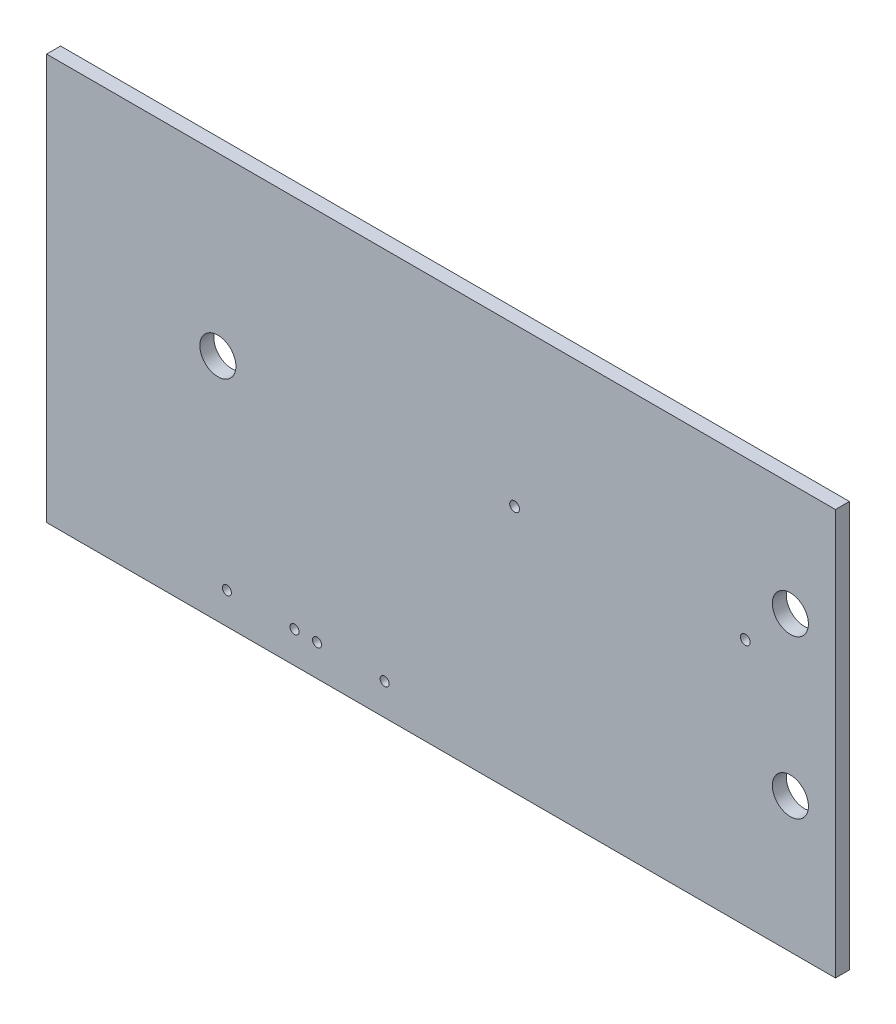
ISO-10303-21;
HEADER;
FILE_DESCRIPTION(('STEP AP214'),'2;1');
FILE_NAME('part.step','',(''),(''),'','','');
FILE_SCHEMA(('AUTOMOTIVE_DESIGN { 1 0 10303 214 1 1 1 1 }'));
ENDSEC;
DATA;
#1=APPLICATION_CONTEXT('core data for automotive mechanical design processes');
#2=APPLICATION_PROTOCOL_DEFINITION('international standard','automotive_design',2000,#1);
#3=PRODUCT_CONTEXT('',#1,'mechanical');
#4=PRODUCT('Part','Part','',(#3));
#5=PRODUCT_RELATED_PRODUCT_CATEGORY('part','',(#4));
#6=PRODUCT_DEFINITION_FORMATION('','',#4);
#7=PRODUCT_DEFINITION_CONTEXT('part definition',#1,'design');
#8=PRODUCT_DEFINITION('design','',#6,#7);
#9=PRODUCT_DEFINITION_SHAPE('','',#8);
#10=(LENGTH_UNIT() NAMED_UNIT(*) SI_UNIT(.MILLI.,.METRE.));
#11=(NAMED_UNIT(*) PLANE_ANGLE_UNIT() SI_UNIT($,.RADIAN.));
#12=(NAMED_UNIT(*) SI_UNIT($,.STERADIAN.) SOLID_ANGLE_UNIT());
#13=UNCERTAINTY_MEASURE_WITH_UNIT(LENGTH_MEASURE(1.E-05),#10,'distance_accuracy_value','');
#14=(GEOMETRIC_REPRESENTATION_CONTEXT(3) GLOBAL_UNCERTAINTY_ASSIGNED_CONTEXT((#13)) GLOBAL_UNIT_ASSIGNED_CONTEXT((#10,
#11,#12)) REPRESENTATION_CONTEXT('',''));
#15=CARTESIAN_POINT('',(0.,0.,0.));
#16=DIRECTION('',(0.,0.,1.));
#17=DIRECTION('',(1.,0.,0.));
#18=AXIS2_PLACEMENT_3D('',#15,#16,#17);
#19=CARTESIAN_POINT('',(0.,0.,1.5748));
#20=DIRECTION('',(1.,0.,0.));
#21=DIRECTION('',(0.,1.,0.));
#22=AXIS2_PLACEMENT_3D('',#19,#20,#21);
#23=PLANE('',#22);
#24=DIRECTION('',(0.,-1.,0.));
#25=VECTOR('',#24,1.);
#26=CARTESIAN_POINT('',(0.,0.,0.));
#27=LINE('',#26,#25);
#28=CARTESIAN_POINT('',(0.,0.,0.));
#29=VERTEX_POINT('',#28);
#30=CARTESIAN_POINT('',(0.,-45.72,0.));
#31=VERTEX_POINT('',#30);
#32=EDGE_CURVE('E75',#29,#31,#27,.T.);
#33=ORIENTED_EDGE('',*,*,#32,.T.);
#34=DIRECTION('',(0.,0.,-1.));
#35=VECTOR('',#34,1.);
#36=CARTESIAN_POINT('',(0.,-45.72,1.5748));
#37=LINE('',#36,#35);
#38=CARTESIAN_POINT('',(0.,-45.72,1.5748));
#39=VERTEX_POINT('',#38);
#40=EDGE_CURVE('E11',#39,#31,#37,.T.);
#41=ORIENTED_EDGE('',*,*,#40,.F.);
#42=DIRECTION('',(0.,-1.,0.));
#43=VECTOR('',#42,1.);
#44=CARTESIAN_POINT('',(0.,0.,1.5748));
#45=LINE('',#44,#43);
#46=CARTESIAN_POINT('',(0.,0.,1.5748));
#47=VERTEX_POINT('',#46);
#48=EDGE_CURVE('E98',#47,#39,#45,.T.);
#49=ORIENTED_EDGE('',*,*,#48,.F.);
#50=DIRECTION('',(0.,0.,-1.));
#51=VECTOR('',#50,1.);
#52=CARTESIAN_POINT('',(0.,0.,1.5748));
#53=LINE('',#52,#51);
#54=EDGE_CURVE('E87',#47,#29,#53,.T.);
#55=ORIENTED_EDGE('',*,*,#54,.T.);
#56=EDGE_LOOP('',(#33,#41,#49,#55));
#57=FACE_BOUND('',#56,.T.);
#58=ADVANCED_FACE('F31',(#57),#23,.F.);
#59=CARTESIAN_POINT('',(0.,-45.72,1.5748));
#60=DIRECTION('',(0.,1.,0.));
#61=DIRECTION('',(0.,0.,1.));
#62=AXIS2_PLACEMENT_3D('',#59,#60,#61);
#63=PLANE('',#62);
#64=DIRECTION('',(1.,0.,0.));
#65=VECTOR('',#64,1.);
#66=CARTESIAN_POINT('',(0.,-45.72,0.));
#67=LINE('',#66,#65);
#68=CARTESIAN_POINT('',(88.9,-45.72,0.));
#69=VERTEX_POINT('',#68);
#70=EDGE_CURVE('E71',#31,#69,#67,.T.);
#71=ORIENTED_EDGE('',*,*,#70,.T.);
#72=DIRECTION('',(0.,0.,-1.));
#73=VECTOR('',#72,1.);
#74=CARTESIAN_POINT('',(88.9,-45.72,1.5748));
#75=LINE('',#74,#73);
#76=CARTESIAN_POINT('',(88.9,-45.72,1.5748));
#77=VERTEX_POINT('',#76);
#78=EDGE_CURVE('E38',#77,#69,#75,.T.);
#79=ORIENTED_EDGE('',*,*,#78,.F.);
#80=DIRECTION('',(1.,0.,0.));
#81=VECTOR('',#80,1.);
#82=CARTESIAN_POINT('',(0.,-45.72,1.5748));
#83=LINE('',#82,#81);
#84=EDGE_CURVE('E83',#39,#77,#83,.T.);
#85=ORIENTED_EDGE('',*,*,#84,.F.);
#86=ORIENTED_EDGE('',*,*,#40,.T.);
#87=EDGE_LOOP('',(#71,#79,#85,#86));
#88=FACE_BOUND('',#87,.T.);
#89=ADVANCED_FACE('F82',(#88),#63,.F.);
#90=CARTESIAN_POINT('',(88.9,0.,1.5748));
#91=DIRECTION('',(-1.,0.,0.));
#92=DIRECTION('',(0.,0.,1.));
#93=AXIS2_PLACEMENT_3D('',#90,#91,#92);
#94=PLANE('',#93);
#95=DIRECTION('',(0.,1.,0.));
#96=VECTOR('',#95,1.);
#97=CARTESIAN_POINT('',(88.9,0.,0.));
#98=LINE('',#97,#96);
#99=CARTESIAN_POINT('',(88.9,0.,0.));
#100=VERTEX_POINT('',#99);
#101=EDGE_CURVE('E76',#69,#100,#98,.T.);
#102=ORIENTED_EDGE('',*,*,#101,.T.);
#103=DIRECTION('',(0.,0.,-1.));
#104=VECTOR('',#103,1.);
#105=CARTESIAN_POINT('',(88.9,0.,1.5748));
#106=LINE('',#105,#104);
#107=CARTESIAN_POINT('',(88.9,0.,1.5748));
#108=VERTEX_POINT('',#107);
#109=EDGE_CURVE('E104',#108,#100,#106,.T.);
#110=ORIENTED_EDGE('',*,*,#109,.F.);
#111=DIRECTION('',(0.,1.,0.));
#112=VECTOR('',#111,1.);
#113=CARTESIAN_POINT('',(88.9,0.,1.5748));
#114=LINE('',#113,#112);
#115=EDGE_CURVE('E50',#77,#108,#114,.T.);
#116=ORIENTED_EDGE('',*,*,#115,.F.);
#117=ORIENTED_EDGE('',*,*,#78,.T.);
#118=EDGE_LOOP('',(#102,#110,#116,#117));
#119=FACE_BOUND('',#118,.T.);
#120=ADVANCED_FACE('F107',(#119),#94,.F.);
#121=CARTESIAN_POINT('',(0.,0.,1.5748));
#122=DIRECTION('',(0.,-1.,0.));
#123=DIRECTION('',(0.,0.,-1.));
#124=AXIS2_PLACEMENT_3D('',#121,#122,#123);
#125=PLANE('',#124);
#126=DIRECTION('',(-1.,0.,0.));
#127=VECTOR('',#126,1.);
#128=CARTESIAN_POINT('',(0.,0.,0.));
#129=LINE('',#128,#127);
#130=EDGE_CURVE('E96',#100,#29,#129,.T.);
#131=ORIENTED_EDGE('',*,*,#130,.T.);
#132=ORIENTED_EDGE('',*,*,#54,.F.);
#133=DIRECTION('',(-1.,0.,0.));
#134=VECTOR('',#133,1.);
#135=CARTESIAN_POINT('',(0.,0.,1.5748));
#136=LINE('',#135,#134);
#137=EDGE_CURVE('E45',#108,#47,#136,.T.);
#138=ORIENTED_EDGE('',*,*,#137,.F.);
#139=ORIENTED_EDGE('',*,*,#109,.T.);
#140=EDGE_LOOP('',(#131,#132,#138,#139));
#141=FACE_BOUND('',#140,.T.);
#142=ADVANCED_FACE('F109',(#141),#125,.F.);
#143=CARTESIAN_POINT('',(0.,-45.72,1.5748));
#144=DIRECTION('',(0.,0.,1.));
#145=DIRECTION('',(1.,0.,0.));
#146=AXIS2_PLACEMENT_3D('',#143,#144,#145);
#147=PLANE('',#146);
#148=CARTESIAN_POINT('',(19.304,-19.812,1.5748));
#149=DIRECTION('',(0.,0.,1.));
#150=DIRECTION('',(1.,0.,0.));
#151=AXIS2_PLACEMENT_3D('',#148,#149,#150);
#152=CIRCLE('',#151,2.032);
#153=CARTESIAN_POINT('',(21.336,-19.812,1.5748));
#154=VERTEX_POINT('',#153);
#155=EDGE_CURVE('E246',#154,#154,#152,.T.);
#156=ORIENTED_EDGE('',*,*,#155,.F.);
#157=EDGE_LOOP('',(#156));
#158=FACE_BOUND('',#157,.T.);
#159=CARTESIAN_POINT('',(83.82,-12.7,1.5748));
#160=DIRECTION('',(0.,0.,1.));
#161=DIRECTION('',(1.,0.,0.));
#162=AXIS2_PLACEMENT_3D('',#159,#160,#161);
#163=CIRCLE('',#162,2.03200000000001);
#164=CARTESIAN_POINT('',(85.852,-12.7,1.5748));
#165=VERTEX_POINT('',#164);
#166=EDGE_CURVE('E248',#165,#165,#163,.T.);
#167=ORIENTED_EDGE('',*,*,#166,.F.);
#168=EDGE_LOOP('',(#167));
#169=FACE_BOUND('',#168,.T.);
#170=CARTESIAN_POINT('',(83.82,-30.48,1.5748));
#171=DIRECTION('',(0.,0.,1.));
#172=DIRECTION('',(1.,0.,0.));
#173=AXIS2_PLACEMENT_3D('',#170,#171,#172);
#174=CIRCLE('',#173,2.03200000000001);
#175=CARTESIAN_POINT('',(85.852,-30.48,1.5748));
#176=VERTEX_POINT('',#175);
#177=EDGE_CURVE('E256',#176,#176,#174,.T.);
#178=ORIENTED_EDGE('',*,*,#177,.F.);
#179=EDGE_LOOP('',(#178));
#180=FACE_BOUND('',#179,.T.);
#181=CARTESIAN_POINT('',(38.1,-42.164,1.5748));
#182=DIRECTION('',(0.,0.,1.));
#183=DIRECTION('',(1.,0.,0.));
#184=AXIS2_PLACEMENT_3D('',#181,#182,#183);
#185=CIRCLE('',#184,0.508000000000001);
#186=CARTESIAN_POINT('',(38.608,-42.164,1.5748));
#187=VERTEX_POINT('',#186);
#188=EDGE_CURVE('E262',#187,#187,#185,.T.);
#189=ORIENTED_EDGE('',*,*,#188,.F.);
#190=EDGE_LOOP('',(#189));
#191=FACE_BOUND('',#190,.T.);
#192=CARTESIAN_POINT('',(30.48,-42.164,1.5748));
#193=DIRECTION('',(0.,0.,1.));
#194=DIRECTION('',(1.,0.,0.));
#195=AXIS2_PLACEMENT_3D('',#192,#193,#194);
#196=CIRCLE('',#195,0.508000000000001);
#197=CARTESIAN_POINT('',(30.988,-42.164,1.5748));
#198=VERTEX_POINT('',#197);
#199=EDGE_CURVE('E268',#198,#198,#196,.T.);
#200=ORIENTED_EDGE('',*,*,#199,.F.);
#201=EDGE_LOOP('',(#200));
#202=FACE_BOUND('',#201,.T.);
#203=CARTESIAN_POINT('',(27.94,-42.164,1.5748));
#204=DIRECTION('',(0.,0.,1.));
#205=DIRECTION('',(1.,0.,0.));
#206=AXIS2_PLACEMENT_3D('',#203,#204,#205);
#207=CIRCLE('',#206,0.508000000000001);
#208=CARTESIAN_POINT('',(28.448,-42.164,1.5748));
#209=VERTEX_POINT('',#208);
#210=EDGE_CURVE('E274',#209,#209,#207,.T.);
#211=ORIENTED_EDGE('',*,*,#210,.F.);
#212=EDGE_LOOP('',(#211));
#213=FACE_BOUND('',#212,.T.);
#214=CARTESIAN_POINT('',(20.32,-42.164,1.5748));
#215=DIRECTION('',(0.,0.,1.));
#216=DIRECTION('',(1.,0.,0.));
#217=AXIS2_PLACEMENT_3D('',#214,#215,#216);
#218=CIRCLE('',#217,0.507999999999994);
#219=CARTESIAN_POINT('',(20.828,-42.164,1.5748));
#220=VERTEX_POINT('',#219);
#221=EDGE_CURVE('E280',#220,#220,#218,.T.);
#222=ORIENTED_EDGE('',*,*,#221,.F.);
#223=EDGE_LOOP('',(#222));
#224=FACE_BOUND('',#223,.T.);
#225=CARTESIAN_POINT('',(78.74,-17.78,1.5748));
#226=DIRECTION('',(0.,0.,1.));
#227=DIRECTION('',(1.,0.,0.));
#228=AXIS2_PLACEMENT_3D('',#225,#226,#227);
#229=CIRCLE('',#228,0.549999999999996);
#230=CARTESIAN_POINT('',(79.29,-17.78,1.5748));
#231=VERTEX_POINT('',#230);
#232=EDGE_CURVE('E286',#231,#231,#229,.T.);
#233=ORIENTED_EDGE('',*,*,#232,.F.);
#234=EDGE_LOOP('',(#233));
#235=FACE_BOUND('',#234,.T.);
#236=CARTESIAN_POINT('',(52.74,-17.78,1.5748));
#237=DIRECTION('',(0.,0.,1.));
#238=DIRECTION('',(1.,0.,0.));
#239=AXIS2_PLACEMENT_3D('',#236,#237,#238);
#240=CIRCLE('',#239,0.550000000000003);
#241=CARTESIAN_POINT('',(53.29,-17.78,1.5748));
#242=VERTEX_POINT('',#241);
#243=EDGE_CURVE('E91',#242,#242,#240,.T.);
#244=ORIENTED_EDGE('',*,*,#243,.F.);
#245=EDGE_LOOP('',(#244));
#246=FACE_BOUND('',#245,.T.);
#247=ORIENTED_EDGE('',*,*,#48,.T.);
#248=ORIENTED_EDGE('',*,*,#84,.T.);
#249=ORIENTED_EDGE('',*,*,#115,.T.);
#250=ORIENTED_EDGE('',*,*,#137,.T.);
#251=EDGE_LOOP('',(#247,#248,#249,#250));
#252=FACE_BOUND('',#251,.T.);
#253=ADVANCED_FACE('F110',(#158,#169,#180,#191,#202,#213,#224,#235,#246,#252),#147,.T.);
#254=CARTESIAN_POINT('',(0.,-45.72,0.));
#255=DIRECTION('',(0.,0.,1.));
#256=DIRECTION('',(1.,0.,0.));
#257=AXIS2_PLACEMENT_3D('',#254,#255,#256);
#258=PLANE('',#257);
#259=CARTESIAN_POINT('',(19.304,-19.812,0.));
#260=DIRECTION('',(0.,0.,1.));
#261=DIRECTION('',(1.,0.,0.));
#262=AXIS2_PLACEMENT_3D('',#259,#260,#261);
#263=CIRCLE('',#262,2.032);
#264=CARTESIAN_POINT('',(21.336,-19.812,0.));
#265=VERTEX_POINT('',#264);
#266=EDGE_CURVE('E244',#265,#265,#263,.T.);
#267=ORIENTED_EDGE('',*,*,#266,.T.);
#268=EDGE_LOOP('',(#267));
#269=FACE_BOUND('',#268,.T.);
#270=CARTESIAN_POINT('',(83.82,-12.7,0.));
#271=DIRECTION('',(0.,0.,1.));
#272=DIRECTION('',(1.,0.,0.));
#273=AXIS2_PLACEMENT_3D('',#270,#271,#272);
#274=CIRCLE('',#273,2.03200000000001);
#275=CARTESIAN_POINT('',(85.852,-12.7,0.));
#276=VERTEX_POINT('',#275);
#277=EDGE_CURVE('E253',#276,#276,#274,.T.);
#278=ORIENTED_EDGE('',*,*,#277,.T.);
#279=EDGE_LOOP('',(#278));
#280=FACE_BOUND('',#279,.T.);
#281=CARTESIAN_POINT('',(83.82,-30.48,0.));
#282=DIRECTION('',(0.,0.,1.));
#283=DIRECTION('',(1.,0.,0.));
#284=AXIS2_PLACEMENT_3D('',#281,#282,#283);
#285=CIRCLE('',#284,2.03200000000001);
#286=CARTESIAN_POINT('',(85.852,-30.48,0.));
#287=VERTEX_POINT('',#286);
#288=EDGE_CURVE('E259',#287,#287,#285,.T.);
#289=ORIENTED_EDGE('',*,*,#288,.T.);
#290=EDGE_LOOP('',(#289));
#291=FACE_BOUND('',#290,.T.);
#292=CARTESIAN_POINT('',(38.1,-42.164,0.));
#293=DIRECTION('',(0.,0.,1.));
#294=DIRECTION('',(1.,0.,0.));
#295=AXIS2_PLACEMENT_3D('',#292,#293,#294);
#296=CIRCLE('',#295,0.508000000000001);
#297=CARTESIAN_POINT('',(38.608,-42.164,0.));
#298=VERTEX_POINT('',#297);
#299=EDGE_CURVE('E265',#298,#298,#296,.T.);
#300=ORIENTED_EDGE('',*,*,#299,.T.);
#301=EDGE_LOOP('',(#300));
#302=FACE_BOUND('',#301,.T.);
#303=CARTESIAN_POINT('',(30.48,-42.164,0.));
#304=DIRECTION('',(0.,0.,1.));
#305=DIRECTION('',(1.,0.,0.));
#306=AXIS2_PLACEMENT_3D('',#303,#304,#305);
#307=CIRCLE('',#306,0.508000000000001);
#308=CARTESIAN_POINT('',(30.988,-42.164,0.));
#309=VERTEX_POINT('',#308);
#310=EDGE_CURVE('E271',#309,#309,#307,.T.);
#311=ORIENTED_EDGE('',*,*,#310,.T.);
#312=EDGE_LOOP('',(#311));
#313=FACE_BOUND('',#312,.T.);
#314=CARTESIAN_POINT('',(27.94,-42.164,0.));
#315=DIRECTION('',(0.,0.,1.));
#316=DIRECTION('',(1.,0.,0.));
#317=AXIS2_PLACEMENT_3D('',#314,#315,#316);
#318=CIRCLE('',#317,0.508000000000001);
#319=CARTESIAN_POINT('',(28.448,-42.164,0.));
#320=VERTEX_POINT('',#319);
#321=EDGE_CURVE('E277',#320,#320,#318,.T.);
#322=ORIENTED_EDGE('',*,*,#321,.T.);
#323=EDGE_LOOP('',(#322));
#324=FACE_BOUND('',#323,.T.);
#325=CARTESIAN_POINT('',(20.32,-42.164,0.));
#326=DIRECTION('',(0.,0.,1.));
#327=DIRECTION('',(1.,0.,0.));
#328=AXIS2_PLACEMENT_3D('',#325,#326,#327);
#329=CIRCLE('',#328,0.507999999999994);
#330=CARTESIAN_POINT('',(20.828,-42.164,0.));
#331=VERTEX_POINT('',#330);
#332=EDGE_CURVE('E283',#331,#331,#329,.T.);
#333=ORIENTED_EDGE('',*,*,#332,.T.);
#334=EDGE_LOOP('',(#333));
#335=FACE_BOUND('',#334,.T.);
#336=CARTESIAN_POINT('',(78.74,-17.78,0.));
#337=DIRECTION('',(0.,0.,1.));
#338=DIRECTION('',(1.,0.,0.));
#339=AXIS2_PLACEMENT_3D('',#336,#337,#338);
#340=CIRCLE('',#339,0.549999999999996);
#341=CARTESIAN_POINT('',(79.29,-17.78,0.));
#342=VERTEX_POINT('',#341);
#343=EDGE_CURVE('E289',#342,#342,#340,.T.);
#344=ORIENTED_EDGE('',*,*,#343,.T.);
#345=EDGE_LOOP('',(#344));
#346=FACE_BOUND('',#345,.T.);
#347=CARTESIAN_POINT('',(52.74,-17.78,0.));
#348=DIRECTION('',(0.,0.,1.));
#349=DIRECTION('',(1.,0.,0.));
#350=AXIS2_PLACEMENT_3D('',#347,#348,#349);
#351=CIRCLE('',#350,0.550000000000003);
#352=CARTESIAN_POINT('',(53.29,-17.78,0.));
#353=VERTEX_POINT('',#352);
#354=EDGE_CURVE('E88',#353,#353,#351,.T.);
#355=ORIENTED_EDGE('',*,*,#354,.T.);
#356=EDGE_LOOP('',(#355));
#357=FACE_BOUND('',#356,.T.);
#358=ORIENTED_EDGE('',*,*,#32,.F.);
#359=ORIENTED_EDGE('',*,*,#130,.F.);
#360=ORIENTED_EDGE('',*,*,#101,.F.);
#361=ORIENTED_EDGE('',*,*,#70,.F.);
#362=EDGE_LOOP('',(#358,#359,#360,#361));
#363=FACE_BOUND('',#362,.T.);
#364=ADVANCED_FACE('F72',(#269,#280,#291,#302,#313,#324,#335,#346,#357,#363),#258,.F.);
#365=CARTESIAN_POINT('',(52.74,-17.78,0.));
#366=DIRECTION('',(0.,0.,1.));
#367=DIRECTION('',(1.,0.,0.));
#368=AXIS2_PLACEMENT_3D('',#365,#366,#367);
#369=CYLINDRICAL_SURFACE('',#368,0.550000000000003);
#370=ORIENTED_EDGE('',*,*,#354,.F.);
#371=EDGE_LOOP('',(#370));
#372=FACE_BOUND('',#371,.T.);
#373=ORIENTED_EDGE('',*,*,#243,.T.);
#374=EDGE_LOOP('',(#373));
#375=FACE_BOUND('',#374,.T.);
#376=ADVANCED_FACE('F118',(#372,#375),#369,.F.);
#377=CARTESIAN_POINT('',(78.74,-17.78,0.));
#378=DIRECTION('',(0.,0.,1.));
#379=DIRECTION('',(1.,0.,0.));
#380=AXIS2_PLACEMENT_3D('',#377,#378,#379);
#381=CYLINDRICAL_SURFACE('',#380,0.549999999999996);
#382=ORIENTED_EDGE('',*,*,#343,.F.);
#383=EDGE_LOOP('',(#382));
#384=FACE_BOUND('',#383,.T.);
#385=ORIENTED_EDGE('',*,*,#232,.T.);
#386=EDGE_LOOP('',(#385));
#387=FACE_BOUND('',#386,.T.);
#388=ADVANCED_FACE('F148',(#384,#387),#381,.F.);
#389=CARTESIAN_POINT('',(20.32,-42.164,0.));
#390=DIRECTION('',(0.,0.,1.));
#391=DIRECTION('',(1.,0.,0.));
#392=AXIS2_PLACEMENT_3D('',#389,#390,#391);
#393=CYLINDRICAL_SURFACE('',#392,0.507999999999994);
#394=ORIENTED_EDGE('',*,*,#332,.F.);
#395=EDGE_LOOP('',(#394));
#396=FACE_BOUND('',#395,.T.);
#397=ORIENTED_EDGE('',*,*,#221,.T.);
#398=EDGE_LOOP('',(#397));
#399=FACE_BOUND('',#398,.T.);
#400=ADVANCED_FACE('F159',(#396,#399),#393,.F.);
#401=CARTESIAN_POINT('',(27.94,-42.164,0.));
#402=DIRECTION('',(0.,0.,1.));
#403=DIRECTION('',(1.,0.,0.));
#404=AXIS2_PLACEMENT_3D('',#401,#402,#403);
#405=CYLINDRICAL_SURFACE('',#404,0.508000000000001);
#406=ORIENTED_EDGE('',*,*,#321,.F.);
#407=EDGE_LOOP('',(#406));
#408=FACE_BOUND('',#407,.T.);
#409=ORIENTED_EDGE('',*,*,#210,.T.);
#410=EDGE_LOOP('',(#409));
#411=FACE_BOUND('',#410,.T.);
#412=ADVANCED_FACE('F169',(#408,#411),#405,.F.);
#413=CARTESIAN_POINT('',(30.48,-42.164,0.));
#414=DIRECTION('',(0.,0.,1.));
#415=DIRECTION('',(1.,0.,0.));
#416=AXIS2_PLACEMENT_3D('',#413,#414,#415);
#417=CYLINDRICAL_SURFACE('',#416,0.508000000000001);
#418=ORIENTED_EDGE('',*,*,#310,.F.);
#419=EDGE_LOOP('',(#418));
#420=FACE_BOUND('',#419,.T.);
#421=ORIENTED_EDGE('',*,*,#199,.T.);
#422=EDGE_LOOP('',(#421));
#423=FACE_BOUND('',#422,.T.);
#424=ADVANCED_FACE('F179',(#420,#423),#417,.F.);
#425=CARTESIAN_POINT('',(38.1,-42.164,0.));
#426=DIRECTION('',(0.,0.,1.));
#427=DIRECTION('',(1.,0.,0.));
#428=AXIS2_PLACEMENT_3D('',#425,#426,#427);
#429=CYLINDRICAL_SURFACE('',#428,0.508000000000001);
#430=ORIENTED_EDGE('',*,*,#299,.F.);
#431=EDGE_LOOP('',(#430));
#432=FACE_BOUND('',#431,.T.);
#433=ORIENTED_EDGE('',*,*,#188,.T.);
#434=EDGE_LOOP('',(#433));
#435=FACE_BOUND('',#434,.T.);
#436=ADVANCED_FACE('F189',(#432,#435),#429,.F.);
#437=CARTESIAN_POINT('',(83.82,-30.48,0.));
#438=DIRECTION('',(0.,0.,1.));
#439=DIRECTION('',(1.,0.,0.));
#440=AXIS2_PLACEMENT_3D('',#437,#438,#439);
#441=CYLINDRICAL_SURFACE('',#440,2.03200000000001);
#442=ORIENTED_EDGE('',*,*,#288,.F.);
#443=EDGE_LOOP('',(#442));
#444=FACE_BOUND('',#443,.T.);
#445=ORIENTED_EDGE('',*,*,#177,.T.);
#446=EDGE_LOOP('',(#445));
#447=FACE_BOUND('',#446,.T.);
#448=ADVANCED_FACE('F198',(#444,#447),#441,.F.);
#449=CARTESIAN_POINT('',(83.82,-12.7,0.));
#450=DIRECTION('',(0.,0.,1.));
#451=DIRECTION('',(1.,0.,0.));
#452=AXIS2_PLACEMENT_3D('',#449,#450,#451);
#453=CYLINDRICAL_SURFACE('',#452,2.03200000000001);
#454=ORIENTED_EDGE('',*,*,#277,.F.);
#455=EDGE_LOOP('',(#454));
#456=FACE_BOUND('',#455,.T.);
#457=ORIENTED_EDGE('',*,*,#166,.T.);
#458=EDGE_LOOP('',(#457));
#459=FACE_BOUND('',#458,.T.);
#460=ADVANCED_FACE('F217',(#456,#459),#453,.F.);
#461=CARTESIAN_POINT('',(19.304,-19.812,0.));
#462=DIRECTION('',(0.,0.,1.));
#463=DIRECTION('',(1.,0.,0.));
#464=AXIS2_PLACEMENT_3D('',#461,#462,#463);
#465=CYLINDRICAL_SURFACE('',#464,2.032);
#466=ORIENTED_EDGE('',*,*,#266,.F.);
#467=EDGE_LOOP('',(#466));
#468=FACE_BOUND('',#467,.T.);
#469=ORIENTED_EDGE('',*,*,#155,.T.);
#470=EDGE_LOOP('',(#469));
#471=FACE_BOUND('',#470,.T.);
#472=ADVANCED_FACE('F227',(#468,#471),#465,.F.);
#473=CLOSED_SHELL('',(#58,#89,#120,#142,#253,#364,#376,#388,#400,#412,#424,#436,#448,#460,#472));
#474=MANIFOLD_SOLID_BREP('B2',#473);
#475=ADVANCED_BREP_SHAPE_REPRESENTATION('',(#18,#474),#14);
#476=SHAPE_DEFINITION_REPRESENTATION(#9,#475);
ENDSEC;
END-ISO-10303-21;
